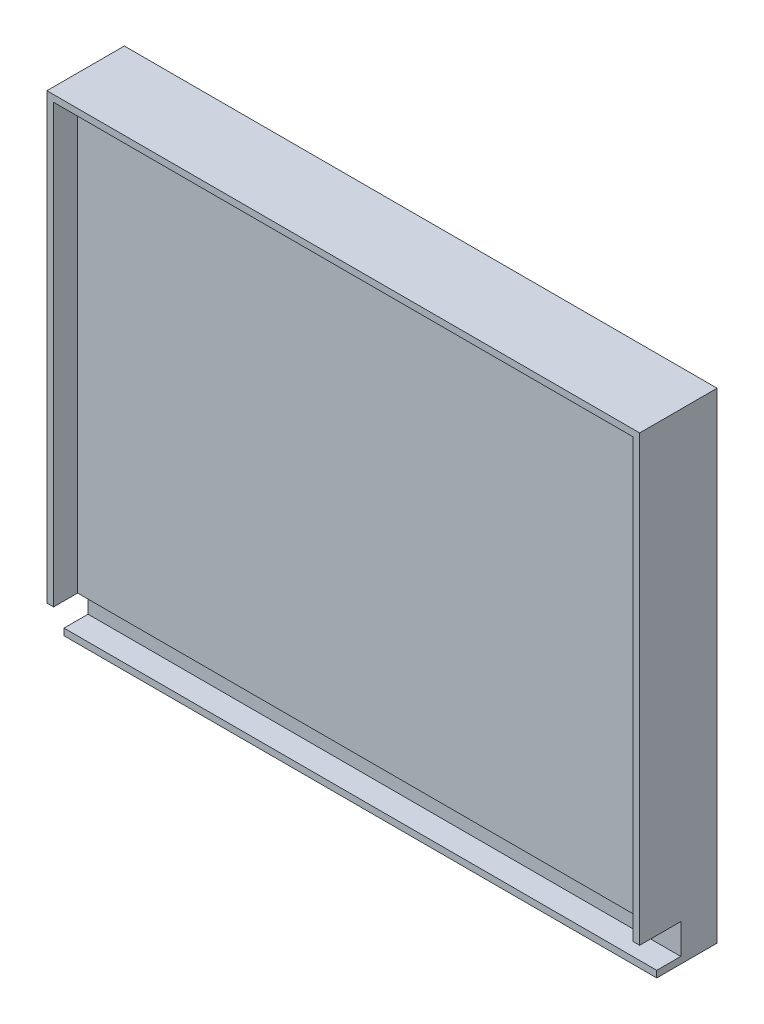
ISO-10303-21;
HEADER;
FILE_DESCRIPTION(('STEP AP214'),'2;1');
FILE_NAME('part.step','',(''),(''),'','','');
FILE_SCHEMA(('AUTOMOTIVE_DESIGN { 1 0 10303 214 1 1 1 1 }'));
ENDSEC;
DATA;
#1=APPLICATION_CONTEXT('core data for automotive mechanical design processes');
#2=APPLICATION_PROTOCOL_DEFINITION('international standard','automotive_design',2000,#1);
#3=PRODUCT_CONTEXT('',#1,'mechanical');
#4=PRODUCT('Part','Part','',(#3));
#5=PRODUCT_RELATED_PRODUCT_CATEGORY('part','',(#4));
#6=PRODUCT_DEFINITION_FORMATION('','',#4);
#7=PRODUCT_DEFINITION_CONTEXT('part definition',#1,'design');
#8=PRODUCT_DEFINITION('design','',#6,#7);
#9=PRODUCT_DEFINITION_SHAPE('','',#8);
#10=(LENGTH_UNIT() NAMED_UNIT(*) SI_UNIT(.MILLI.,.METRE.));
#11=(NAMED_UNIT(*) PLANE_ANGLE_UNIT() SI_UNIT($,.RADIAN.));
#12=(NAMED_UNIT(*) SI_UNIT($,.STERADIAN.) SOLID_ANGLE_UNIT());
#13=UNCERTAINTY_MEASURE_WITH_UNIT(LENGTH_MEASURE(1.E-05),#10,'distance_accuracy_value','');
#14=(GEOMETRIC_REPRESENTATION_CONTEXT(3) GLOBAL_UNCERTAINTY_ASSIGNED_CONTEXT((#13)) GLOBAL_UNIT_ASSIGNED_CONTEXT((#10,
#11,#12)) REPRESENTATION_CONTEXT('',''));
#15=CARTESIAN_POINT('',(0.,0.,0.));
#16=DIRECTION('',(0.,0.,1.));
#17=DIRECTION('',(1.,0.,0.));
#18=AXIS2_PLACEMENT_3D('',#15,#16,#17);
#19=CARTESIAN_POINT('',(-68.3631707317073,-94.7853658536585,17.272));
#20=DIRECTION('',(-1.,0.,0.));
#21=DIRECTION('',(0.,0.,1.));
#22=AXIS2_PLACEMENT_3D('',#19,#20,#21);
#23=PLANE('',#22);
#24=DIRECTION('',(0.,0.,-1.));
#25=VECTOR('',#24,1.);
#26=CARTESIAN_POINT('',(-68.3631707317073,-97.9603658536585,17.272));
#27=LINE('',#26,#25);
#28=CARTESIAN_POINT('',(-68.3631707317073,-97.9603658536585,28.702));
#29=VERTEX_POINT('',#28);
#30=CARTESIAN_POINT('',(-68.3631707317073,-97.9603658536585,0.));
#31=VERTEX_POINT('',#30);
#32=EDGE_CURVE('E102',#29,#31,#27,.T.);
#33=ORIENTED_EDGE('',*,*,#32,.F.);
#34=DIRECTION('',(0.,-1.,0.));
#35=VECTOR('',#34,1.);
#36=CARTESIAN_POINT('',(-68.3631707317073,-94.7853658536585,28.702));
#37=LINE('',#36,#35);
#38=CARTESIAN_POINT('',(-68.3631707317073,-94.7853658536585,28.702));
#39=VERTEX_POINT('',#38);
#40=EDGE_CURVE('E11',#39,#29,#37,.T.);
#41=ORIENTED_EDGE('',*,*,#40,.F.);
#42=DIRECTION('',(0.,0.,-1.));
#43=VECTOR('',#42,1.);
#44=CARTESIAN_POINT('',(-68.3631707317073,-94.7853658536585,17.272));
#45=LINE('',#44,#43);
#46=CARTESIAN_POINT('',(-68.3631707317073,-94.7853658536585,17.272));
#47=VERTEX_POINT('',#46);
#48=EDGE_CURVE('E91',#39,#47,#45,.T.);
#49=ORIENTED_EDGE('',*,*,#48,.T.);
#50=DIRECTION('',(0.,-1.,0.));
#51=VECTOR('',#50,1.);
#52=CARTESIAN_POINT('',(-68.3631707317073,-97.9603658536585,17.272));
#53=LINE('',#52,#51);
#54=CARTESIAN_POINT('',(-68.3631707317074,-80.4343658536585,17.272));
#55=VERTEX_POINT('',#54);
#56=EDGE_CURVE('E202',#55,#47,#53,.T.);
#57=ORIENTED_EDGE('',*,*,#56,.F.);
#58=DIRECTION('',(0.,0.,1.));
#59=VECTOR('',#58,1.);
#60=CARTESIAN_POINT('',(-68.3631707317074,-80.4343658536585,17.272));
#61=LINE('',#60,#59);
#62=CARTESIAN_POINT('',(-68.3631707317073,-80.4343658536585,36.83));
#63=VERTEX_POINT('',#62);
#64=EDGE_CURVE('E143',#55,#63,#61,.T.);
#65=ORIENTED_EDGE('',*,*,#64,.T.);
#66=DIRECTION('',(0.,1.,0.));
#67=VECTOR('',#66,1.);
#68=CARTESIAN_POINT('',(-68.3631707317074,130.639634146342,36.83));
#69=LINE('',#68,#67);
#70=CARTESIAN_POINT('',(-68.3631707317074,130.639634146342,36.83));
#71=VERTEX_POINT('',#70);
#72=EDGE_CURVE('E274',#63,#71,#69,.T.);
#73=ORIENTED_EDGE('',*,*,#72,.T.);
#74=DIRECTION('',(0.,0.,-1.));
#75=VECTOR('',#74,1.);
#76=CARTESIAN_POINT('',(-68.3631707317074,130.639634146342,25.4));
#77=LINE('',#76,#75);
#78=CARTESIAN_POINT('',(-68.3631707317074,130.639634146342,0.));
#79=VERTEX_POINT('',#78);
#80=EDGE_CURVE('E141',#71,#79,#77,.T.);
#81=ORIENTED_EDGE('',*,*,#80,.T.);
#82=DIRECTION('',(0.,-1.,0.));
#83=VECTOR('',#82,1.);
#84=CARTESIAN_POINT('',(-68.3631707317074,130.639634146342,0.));
#85=LINE('',#84,#83);
#86=EDGE_CURVE('E133',#79,#31,#85,.T.);
#87=ORIENTED_EDGE('',*,*,#86,.T.);
#88=EDGE_LOOP('',(#33,#41,#49,#57,#65,#73,#81,#87));
#89=FACE_BOUND('',#88,.T.);
#90=ADVANCED_FACE('F43',(#89),#23,.T.);
#91=CARTESIAN_POINT('',(-68.3631707317073,-94.7853658536585,28.702));
#92=DIRECTION('',(0.,0.,1.));
#93=DIRECTION('',(1.,0.,0.));
#94=AXIS2_PLACEMENT_3D('',#91,#92,#93);
#95=PLANE('',#94);
#96=DIRECTION('',(-1.,0.,0.));
#97=VECTOR('',#96,1.);
#98=CARTESIAN_POINT('',(-68.3631707317073,-97.9603658536585,28.702));
#99=LINE('',#98,#97);
#100=CARTESIAN_POINT('',(213.576829268293,-97.9603658536585,28.702));
#101=VERTEX_POINT('',#100);
#102=EDGE_CURVE('E88',#101,#29,#99,.T.);
#103=ORIENTED_EDGE('',*,*,#102,.F.);
#104=DIRECTION('',(0.,-1.,0.));
#105=VECTOR('',#104,1.);
#106=CARTESIAN_POINT('',(213.576829268293,-94.7853658536585,28.702));
#107=LINE('',#106,#105);
#108=CARTESIAN_POINT('',(213.576829268293,-94.7853658536585,28.702));
#109=VERTEX_POINT('',#108);
#110=EDGE_CURVE('E47',#109,#101,#107,.T.);
#111=ORIENTED_EDGE('',*,*,#110,.F.);
#112=DIRECTION('',(-1.,0.,0.));
#113=VECTOR('',#112,1.);
#114=CARTESIAN_POINT('',(-68.3631707317073,-94.7853658536585,28.702));
#115=LINE('',#114,#113);
#116=EDGE_CURVE('E86',#109,#39,#115,.T.);
#117=ORIENTED_EDGE('',*,*,#116,.T.);
#118=ORIENTED_EDGE('',*,*,#40,.T.);
#119=EDGE_LOOP('',(#103,#111,#117,#118));
#120=FACE_BOUND('',#119,.T.);
#121=ADVANCED_FACE('F85',(#120),#95,.T.);
#122=CARTESIAN_POINT('',(213.576829268293,-94.7853658536585,28.702));
#123=DIRECTION('',(1.,0.,0.));
#124=DIRECTION('',(0.,0.,-1.));
#125=AXIS2_PLACEMENT_3D('',#122,#123,#124);
#126=PLANE('',#125);
#127=DIRECTION('',(0.,0.,1.));
#128=VECTOR('',#127,1.);
#129=CARTESIAN_POINT('',(213.576829268293,-97.9603658536585,28.702));
#130=LINE('',#129,#128);
#131=CARTESIAN_POINT('',(213.576829268293,-97.9603658536585,0.));
#132=VERTEX_POINT('',#131);
#133=EDGE_CURVE('E108',#132,#101,#130,.T.);
#134=ORIENTED_EDGE('',*,*,#133,.F.);
#135=DIRECTION('',(0.,1.,0.));
#136=VECTOR('',#135,1.);
#137=CARTESIAN_POINT('',(213.576829268293,130.639634146342,0.));
#138=LINE('',#137,#136);
#139=CARTESIAN_POINT('',(213.576829268293,130.639634146342,0.));
#140=VERTEX_POINT('',#139);
#141=EDGE_CURVE('E135',#132,#140,#138,.T.);
#142=ORIENTED_EDGE('',*,*,#141,.T.);
#143=DIRECTION('',(0.,0.,-1.));
#144=VECTOR('',#143,1.);
#145=CARTESIAN_POINT('',(213.576829268293,130.639634146342,25.4));
#146=LINE('',#145,#144);
#147=CARTESIAN_POINT('',(213.576829268293,130.639634146342,36.83));
#148=VERTEX_POINT('',#147);
#149=EDGE_CURVE('E111',#148,#140,#146,.T.);
#150=ORIENTED_EDGE('',*,*,#149,.F.);
#151=DIRECTION('',(0.,1.,0.));
#152=VECTOR('',#151,1.);
#153=CARTESIAN_POINT('',(213.576829268293,127.464634146342,36.83));
#154=LINE('',#153,#152);
#155=CARTESIAN_POINT('',(213.576829268293,-80.4343658536585,36.83));
#156=VERTEX_POINT('',#155);
#157=EDGE_CURVE('E172',#156,#148,#154,.T.);
#158=ORIENTED_EDGE('',*,*,#157,.F.);
#159=DIRECTION('',(0.,0.,1.));
#160=VECTOR('',#159,1.);
#161=CARTESIAN_POINT('',(213.576829268293,-80.4343658536585,17.272));
#162=LINE('',#161,#160);
#163=CARTESIAN_POINT('',(213.576829268293,-80.4343658536585,17.272));
#164=VERTEX_POINT('',#163);
#165=EDGE_CURVE('E147',#164,#156,#162,.T.);
#166=ORIENTED_EDGE('',*,*,#165,.F.);
#167=DIRECTION('',(0.,1.,0.));
#168=VECTOR('',#167,1.);
#169=CARTESIAN_POINT('',(213.576829268293,-80.4343658536585,17.272));
#170=LINE('',#169,#168);
#171=CARTESIAN_POINT('',(213.576829268293,-94.7853658536585,17.272));
#172=VERTEX_POINT('',#171);
#173=EDGE_CURVE('E98',#172,#164,#170,.T.);
#174=ORIENTED_EDGE('',*,*,#173,.F.);
#175=DIRECTION('',(0.,0.,1.));
#176=VECTOR('',#175,1.);
#177=CARTESIAN_POINT('',(213.576829268293,-94.7853658536585,28.702));
#178=LINE('',#177,#176);
#179=EDGE_CURVE('E78',#172,#109,#178,.T.);
#180=ORIENTED_EDGE('',*,*,#179,.T.);
#181=ORIENTED_EDGE('',*,*,#110,.T.);
#182=EDGE_LOOP('',(#134,#142,#150,#158,#166,#174,#180,#181));
#183=FACE_BOUND('',#182,.T.);
#184=ADVANCED_FACE('F45',(#183),#126,.T.);
#185=CARTESIAN_POINT('',(0.,-94.7853658536585,0.));
#186=DIRECTION('',(0.,1.,0.));
#187=DIRECTION('',(0.,0.,1.));
#188=AXIS2_PLACEMENT_3D('',#185,#186,#187);
#189=PLANE('',#188);
#190=DIRECTION('',(1.,0.,0.));
#191=VECTOR('',#190,1.);
#192=CARTESIAN_POINT('',(213.576829268293,-94.7853658536585,17.272));
#193=LINE('',#192,#191);
#194=EDGE_CURVE('E61',#47,#172,#193,.T.);
#195=ORIENTED_EDGE('',*,*,#194,.F.);
#196=ORIENTED_EDGE('',*,*,#48,.F.);
#197=ORIENTED_EDGE('',*,*,#116,.F.);
#198=ORIENTED_EDGE('',*,*,#179,.F.);
#199=EDGE_LOOP('',(#195,#196,#197,#198));
#200=FACE_BOUND('',#199,.T.);
#201=ADVANCED_FACE('F92',(#200),#189,.T.);
#202=CARTESIAN_POINT('',(0.,-97.9603658536585,0.));
#203=DIRECTION('',(0.,1.,0.));
#204=DIRECTION('',(0.,0.,1.));
#205=AXIS2_PLACEMENT_3D('',#202,#203,#204);
#206=PLANE('',#205);
#207=ORIENTED_EDGE('',*,*,#32,.T.);
#208=DIRECTION('',(1.,0.,0.));
#209=VECTOR('',#208,1.);
#210=CARTESIAN_POINT('',(-68.3631707317073,-97.9603658536585,0.));
#211=LINE('',#210,#209);
#212=EDGE_CURVE('E123',#31,#132,#211,.T.);
#213=ORIENTED_EDGE('',*,*,#212,.T.);
#214=ORIENTED_EDGE('',*,*,#133,.T.);
#215=ORIENTED_EDGE('',*,*,#102,.T.);
#216=EDGE_LOOP('',(#207,#213,#214,#215));
#217=FACE_BOUND('',#216,.T.);
#218=ADVANCED_FACE('F121',(#217),#206,.F.);
#219=CARTESIAN_POINT('',(0.,0.,17.272));
#220=DIRECTION('',(0.,0.,-1.));
#221=DIRECTION('',(-1.,0.,0.));
#222=AXIS2_PLACEMENT_3D('',#219,#220,#221);
#223=PLANE('',#222);
#224=ORIENTED_EDGE('',*,*,#56,.T.);
#225=ORIENTED_EDGE('',*,*,#194,.T.);
#226=ORIENTED_EDGE('',*,*,#173,.T.);
#227=DIRECTION('',(-1.,0.,0.));
#228=VECTOR('',#227,1.);
#229=CARTESIAN_POINT('',(-68.3631707317074,-80.4343658536585,17.272));
#230=LINE('',#229,#228);
#231=EDGE_CURVE('E198',#164,#55,#230,.T.);
#232=ORIENTED_EDGE('',*,*,#231,.T.);
#233=EDGE_LOOP('',(#224,#225,#226,#232));
#234=FACE_BOUND('',#233,.T.);
#235=ADVANCED_FACE('F297',(#234),#223,.F.);
#236=CARTESIAN_POINT('',(0.,0.,25.4));
#237=DIRECTION('',(0.,0.,1.));
#238=DIRECTION('',(1.,0.,0.));
#239=AXIS2_PLACEMENT_3D('',#236,#237,#238);
#240=PLANE('',#239);
#241=DIRECTION('',(0.,1.,0.));
#242=VECTOR('',#241,1.);
#243=CARTESIAN_POINT('',(210.401829268293,127.464634146342,25.4));
#244=LINE('',#243,#242);
#245=CARTESIAN_POINT('',(210.401829268293,-80.4343658536585,25.4));
#246=VERTEX_POINT('',#245);
#247=CARTESIAN_POINT('',(210.401829268293,127.464634146342,25.4));
#248=VERTEX_POINT('',#247);
#249=EDGE_CURVE('E246',#246,#248,#244,.T.);
#250=ORIENTED_EDGE('',*,*,#249,.T.);
#251=DIRECTION('',(-1.,0.,0.));
#252=VECTOR('',#251,1.);
#253=CARTESIAN_POINT('',(-65.1881707317074,127.464634146342,25.4));
#254=LINE('',#253,#252);
#255=CARTESIAN_POINT('',(-65.1881707317074,127.464634146342,25.4));
#256=VERTEX_POINT('',#255);
#257=EDGE_CURVE('E256',#248,#256,#254,.T.);
#258=ORIENTED_EDGE('',*,*,#257,.T.);
#259=DIRECTION('',(0.,-1.,0.));
#260=VECTOR('',#259,1.);
#261=CARTESIAN_POINT('',(-65.1881707317073,-80.4343658536585,25.4));
#262=LINE('',#261,#260);
#263=CARTESIAN_POINT('',(-65.1881707317073,-80.4343658536585,25.4));
#264=VERTEX_POINT('',#263);
#265=EDGE_CURVE('E277',#256,#264,#262,.T.);
#266=ORIENTED_EDGE('',*,*,#265,.T.);
#267=DIRECTION('',(-1.,0.,0.));
#268=VECTOR('',#267,1.);
#269=CARTESIAN_POINT('',(-68.3631707317074,-80.4343658536585,25.4));
#270=LINE('',#269,#268);
#271=EDGE_CURVE('E185',#246,#264,#270,.T.);
#272=ORIENTED_EDGE('',*,*,#271,.F.);
#273=EDGE_LOOP('',(#250,#258,#266,#272));
#274=FACE_BOUND('',#273,.T.);
#275=ADVANCED_FACE('F254',(#274),#240,.T.);
#276=CARTESIAN_POINT('',(-68.3631707317074,130.639634146342,25.4));
#277=DIRECTION('',(0.,-1.,0.));
#278=DIRECTION('',(1.,0.,0.));
#279=AXIS2_PLACEMENT_3D('',#276,#277,#278);
#280=PLANE('',#279);
#281=ORIENTED_EDGE('',*,*,#80,.F.);
#282=DIRECTION('',(1.,0.,0.));
#283=VECTOR('',#282,1.);
#284=CARTESIAN_POINT('',(213.576829268293,130.639634146342,36.83));
#285=LINE('',#284,#283);
#286=EDGE_CURVE('E167',#71,#148,#285,.T.);
#287=ORIENTED_EDGE('',*,*,#286,.T.);
#288=ORIENTED_EDGE('',*,*,#149,.T.);
#289=DIRECTION('',(-1.,0.,0.));
#290=VECTOR('',#289,1.);
#291=CARTESIAN_POINT('',(-68.3631707317074,130.639634146342,0.));
#292=LINE('',#291,#290);
#293=EDGE_CURVE('E153',#140,#79,#292,.T.);
#294=ORIENTED_EDGE('',*,*,#293,.T.);
#295=EDGE_LOOP('',(#281,#287,#288,#294));
#296=FACE_BOUND('',#295,.T.);
#297=ADVANCED_FACE('F164',(#296),#280,.F.);
#298=CARTESIAN_POINT('',(0.,0.,0.));
#299=DIRECTION('',(0.,0.,1.));
#300=DIRECTION('',(1.,0.,0.));
#301=AXIS2_PLACEMENT_3D('',#298,#299,#300);
#302=PLANE('',#301);
#303=ORIENTED_EDGE('',*,*,#86,.F.);
#304=ORIENTED_EDGE('',*,*,#293,.F.);
#305=ORIENTED_EDGE('',*,*,#141,.F.);
#306=ORIENTED_EDGE('',*,*,#212,.F.);
#307=EDGE_LOOP('',(#303,#304,#305,#306));
#308=FACE_BOUND('',#307,.T.);
#309=ADVANCED_FACE('F131',(#308),#302,.F.);
#310=CARTESIAN_POINT('',(-68.3631707317074,-80.4343658536585,17.272));
#311=DIRECTION('',(0.,1.,0.));
#312=DIRECTION('',(0.,0.,1.));
#313=AXIS2_PLACEMENT_3D('',#310,#311,#312);
#314=PLANE('',#313);
#315=ORIENTED_EDGE('',*,*,#165,.T.);
#316=DIRECTION('',(1.,0.,0.));
#317=VECTOR('',#316,1.);
#318=CARTESIAN_POINT('',(210.401829268293,-80.4343658536585,36.83));
#319=LINE('',#318,#317);
#320=CARTESIAN_POINT('',(210.401829268293,-80.4343658536585,36.83));
#321=VERTEX_POINT('',#320);
#322=EDGE_CURVE('E183',#321,#156,#319,.T.);
#323=ORIENTED_EDGE('',*,*,#322,.F.);
#324=DIRECTION('',(0.,0.,-1.));
#325=VECTOR('',#324,1.);
#326=CARTESIAN_POINT('',(210.401829268293,-80.4343658536585,25.4));
#327=LINE('',#326,#325);
#328=EDGE_CURVE('E289',#321,#246,#327,.T.);
#329=ORIENTED_EDGE('',*,*,#328,.T.);
#330=ORIENTED_EDGE('',*,*,#271,.T.);
#331=DIRECTION('',(0.,0.,1.));
#332=VECTOR('',#331,1.);
#333=CARTESIAN_POINT('',(-65.1881707317073,-80.4343658536585,36.83));
#334=LINE('',#333,#332);
#335=CARTESIAN_POINT('',(-65.1881707317073,-80.4343658536585,36.83));
#336=VERTEX_POINT('',#335);
#337=EDGE_CURVE('E281',#264,#336,#334,.T.);
#338=ORIENTED_EDGE('',*,*,#337,.T.);
#339=DIRECTION('',(-1.,0.,0.));
#340=VECTOR('',#339,1.);
#341=CARTESIAN_POINT('',(-65.1881707317073,-80.4343658536585,36.83));
#342=LINE('',#341,#340);
#343=EDGE_CURVE('E268',#336,#63,#342,.T.);
#344=ORIENTED_EDGE('',*,*,#343,.T.);
#345=ORIENTED_EDGE('',*,*,#64,.F.);
#346=ORIENTED_EDGE('',*,*,#231,.F.);
#347=EDGE_LOOP('',(#315,#323,#329,#330,#338,#344,#345,#346));
#348=FACE_BOUND('',#347,.T.);
#349=ADVANCED_FACE('F211',(#348),#314,.F.);
#350=CARTESIAN_POINT('',(213.576829268293,127.464634146342,36.83));
#351=DIRECTION('',(0.,0.,1.));
#352=DIRECTION('',(1.,0.,0.));
#353=AXIS2_PLACEMENT_3D('',#350,#351,#352);
#354=PLANE('',#353);
#355=ORIENTED_EDGE('',*,*,#286,.F.);
#356=ORIENTED_EDGE('',*,*,#72,.F.);
#357=ORIENTED_EDGE('',*,*,#343,.F.);
#358=DIRECTION('',(0.,1.,0.));
#359=VECTOR('',#358,1.);
#360=CARTESIAN_POINT('',(-65.1881707317074,130.639634146342,36.83));
#361=LINE('',#360,#359);
#362=CARTESIAN_POINT('',(-65.1881707317074,127.464634146342,36.83));
#363=VERTEX_POINT('',#362);
#364=EDGE_CURVE('E273',#336,#363,#361,.T.);
#365=ORIENTED_EDGE('',*,*,#364,.T.);
#366=DIRECTION('',(1.,0.,0.));
#367=VECTOR('',#366,1.);
#368=CARTESIAN_POINT('',(213.576829268293,127.464634146342,36.83));
#369=LINE('',#368,#367);
#370=CARTESIAN_POINT('',(210.401829268293,127.464634146342,36.83));
#371=VERTEX_POINT('',#370);
#372=EDGE_CURVE('E186',#363,#371,#369,.T.);
#373=ORIENTED_EDGE('',*,*,#372,.T.);
#374=DIRECTION('',(0.,-1.,0.));
#375=VECTOR('',#374,1.);
#376=CARTESIAN_POINT('',(210.401829268293,-80.4343658536585,36.83));
#377=LINE('',#376,#375);
#378=EDGE_CURVE('E247',#371,#321,#377,.T.);
#379=ORIENTED_EDGE('',*,*,#378,.T.);
#380=ORIENTED_EDGE('',*,*,#322,.T.);
#381=ORIENTED_EDGE('',*,*,#157,.T.);
#382=EDGE_LOOP('',(#355,#356,#357,#365,#373,#379,#380,#381));
#383=FACE_BOUND('',#382,.T.);
#384=ADVANCED_FACE('F178',(#383),#354,.T.);
#385=CARTESIAN_POINT('',(0.,127.464634146342,0.));
#386=DIRECTION('',(0.,-1.,0.));
#387=DIRECTION('',(1.,0.,0.));
#388=AXIS2_PLACEMENT_3D('',#385,#386,#387);
#389=PLANE('',#388);
#390=DIRECTION('',(0.,0.,1.));
#391=VECTOR('',#390,1.);
#392=CARTESIAN_POINT('',(210.401829268293,127.464634146342,36.83));
#393=LINE('',#392,#391);
#394=EDGE_CURVE('E242',#248,#371,#393,.T.);
#395=ORIENTED_EDGE('',*,*,#394,.T.);
#396=ORIENTED_EDGE('',*,*,#372,.F.);
#397=DIRECTION('',(0.,0.,1.));
#398=VECTOR('',#397,1.);
#399=CARTESIAN_POINT('',(-65.1881707317074,127.464634146342,36.83));
#400=LINE('',#399,#398);
#401=EDGE_CURVE('E192',#256,#363,#400,.T.);
#402=ORIENTED_EDGE('',*,*,#401,.F.);
#403=ORIENTED_EDGE('',*,*,#257,.F.);
#404=EDGE_LOOP('',(#395,#396,#402,#403));
#405=FACE_BOUND('',#404,.T.);
#406=ADVANCED_FACE('F260',(#405),#389,.T.);
#407=CARTESIAN_POINT('',(-65.1881707317074,0.,0.));
#408=DIRECTION('',(1.,0.,0.));
#409=DIRECTION('',(0.,1.,0.));
#410=AXIS2_PLACEMENT_3D('',#407,#408,#409);
#411=PLANE('',#410);
#412=ORIENTED_EDGE('',*,*,#265,.F.);
#413=ORIENTED_EDGE('',*,*,#401,.T.);
#414=ORIENTED_EDGE('',*,*,#364,.F.);
#415=ORIENTED_EDGE('',*,*,#337,.F.);
#416=EDGE_LOOP('',(#412,#413,#414,#415));
#417=FACE_BOUND('',#416,.T.);
#418=ADVANCED_FACE('F296',(#417),#411,.T.);
#419=CARTESIAN_POINT('',(210.401829268293,0.,0.));
#420=DIRECTION('',(-1.,0.,0.));
#421=DIRECTION('',(0.,0.,1.));
#422=AXIS2_PLACEMENT_3D('',#419,#420,#421);
#423=PLANE('',#422);
#424=ORIENTED_EDGE('',*,*,#249,.F.);
#425=ORIENTED_EDGE('',*,*,#328,.F.);
#426=ORIENTED_EDGE('',*,*,#378,.F.);
#427=ORIENTED_EDGE('',*,*,#394,.F.);
#428=EDGE_LOOP('',(#424,#425,#426,#427));
#429=FACE_BOUND('',#428,.T.);
#430=ADVANCED_FACE('F244',(#429),#423,.T.);
#431=CLOSED_SHELL('',(#90,#121,#184,#201,#218,#235,#275,#297,#309,#349,#384,#406,#418,#430));
#432=MANIFOLD_SOLID_BREP('B2',#431);
#433=ADVANCED_BREP_SHAPE_REPRESENTATION('',(#18,#432),#14);
#434=SHAPE_DEFINITION_REPRESENTATION(#9,#433);
ENDSEC;
END-ISO-10303-21;
